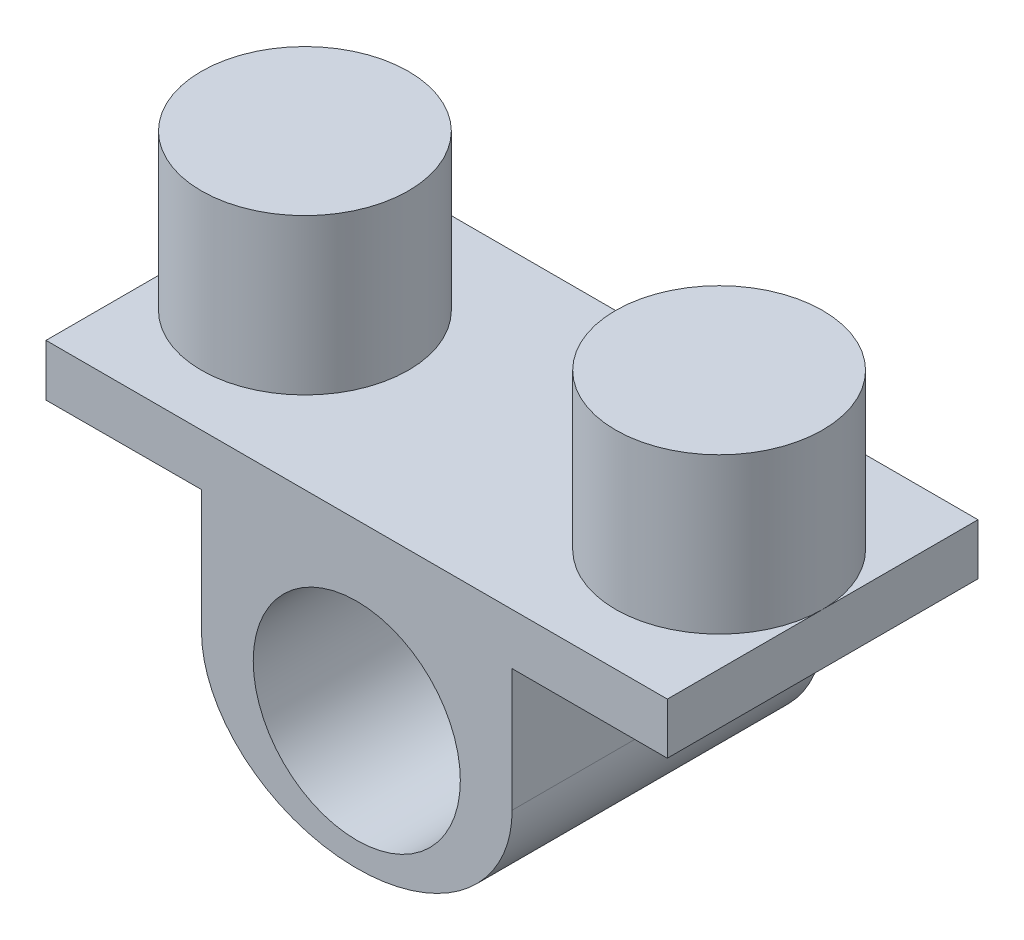
ISO-10303-21;
HEADER;
FILE_DESCRIPTION(('STEP AP214'),'2;1');
FILE_NAME('part.step','',(''),(''),'','','');
FILE_SCHEMA(('AUTOMOTIVE_DESIGN { 1 0 10303 214 1 1 1 1 }'));
ENDSEC;
DATA;
#1=APPLICATION_CONTEXT('core data for automotive mechanical design processes');
#2=APPLICATION_PROTOCOL_DEFINITION('international standard','automotive_design',2000,#1);
#3=PRODUCT_CONTEXT('',#1,'mechanical');
#4=PRODUCT('Part','Part','',(#3));
#5=PRODUCT_RELATED_PRODUCT_CATEGORY('part','',(#4));
#6=PRODUCT_DEFINITION_FORMATION('','',#4);
#7=PRODUCT_DEFINITION_CONTEXT('part definition',#1,'design');
#8=PRODUCT_DEFINITION('design','',#6,#7);
#9=PRODUCT_DEFINITION_SHAPE('','',#8);
#10=(LENGTH_UNIT() NAMED_UNIT(*) SI_UNIT(.MILLI.,.METRE.));
#11=(NAMED_UNIT(*) PLANE_ANGLE_UNIT() SI_UNIT($,.RADIAN.));
#12=(NAMED_UNIT(*) SI_UNIT($,.STERADIAN.) SOLID_ANGLE_UNIT());
#13=UNCERTAINTY_MEASURE_WITH_UNIT(LENGTH_MEASURE(1.E-05),#10,'distance_accuracy_value','');
#14=(GEOMETRIC_REPRESENTATION_CONTEXT(3) GLOBAL_UNCERTAINTY_ASSIGNED_CONTEXT((#13)) GLOBAL_UNIT_ASSIGNED_CONTEXT((#10,
#11,#12)) REPRESENTATION_CONTEXT('',''));
#15=CARTESIAN_POINT('',(0.,0.,0.));
#16=DIRECTION('',(0.,0.,1.));
#17=DIRECTION('',(1.,0.,0.));
#18=AXIS2_PLACEMENT_3D('',#15,#16,#17);
#19=CARTESIAN_POINT('',(-0.0217298672182416,33.60944127678,60.));
#20=DIRECTION('',(0.,-1.,0.));
#21=DIRECTION('',(1.,0.,0.));
#22=AXIS2_PLACEMENT_3D('',#19,#20,#21);
#23=PLANE('',#22);
#24=DIRECTION('',(0.,0.,-1.));
#25=VECTOR('',#24,1.);
#26=CARTESIAN_POINT('',(-60.0217298672183,33.60944127678,60.));
#27=LINE('',#26,#25);
#28=CARTESIAN_POINT('',(-60.0217298672183,33.60944127678,30.));
#29=VERTEX_POINT('',#28);
#30=CARTESIAN_POINT('',(-60.0217298672183,33.60944127678,0.));
#31=VERTEX_POINT('',#30);
#32=EDGE_CURVE('E141',#29,#31,#27,.T.);
#33=ORIENTED_EDGE('',*,*,#32,.F.);
#34=CARTESIAN_POINT('',(-40.0217298672183,33.60944127678,30.));
#35=DIRECTION('',(0.,1.,0.));
#36=DIRECTION('',(-1.,0.,0.));
#37=AXIS2_PLACEMENT_3D('',#34,#35,#36);
#38=CIRCLE('',#37,20.);
#39=EDGE_CURVE('E139',#29,#29,#38,.T.);
#40=ORIENTED_EDGE('',*,*,#39,.F.);
#41=CARTESIAN_POINT('',(-60.0217298672183,33.60944127678,60.));
#42=VERTEX_POINT('',#41);
#43=EDGE_CURVE('E121',#42,#29,#27,.T.);
#44=ORIENTED_EDGE('',*,*,#43,.F.);
#45=DIRECTION('',(-1.,0.,0.));
#46=VECTOR('',#45,1.);
#47=CARTESIAN_POINT('',(-0.0217298672182416,33.60944127678,60.));
#48=LINE('',#47,#46);
#49=CARTESIAN_POINT('',(59.9782701327817,33.60944127678,60.));
#50=VERTEX_POINT('',#49);
#51=EDGE_CURVE('E126',#50,#42,#48,.T.);
#52=ORIENTED_EDGE('',*,*,#51,.F.);
#53=DIRECTION('',(0.,0.,-1.));
#54=VECTOR('',#53,1.);
#55=CARTESIAN_POINT('',(59.9782701327817,33.60944127678,60.));
#56=LINE('',#55,#54);
#57=CARTESIAN_POINT('',(59.9782701327817,33.60944127678,30.));
#58=VERTEX_POINT('',#57);
#59=EDGE_CURVE('E143',#50,#58,#56,.T.);
#60=ORIENTED_EDGE('',*,*,#59,.T.);
#61=CARTESIAN_POINT('',(39.9782701327817,33.60944127678,30.));
#62=DIRECTION('',(0.,1.,0.));
#63=DIRECTION('',(-1.,0.,0.));
#64=AXIS2_PLACEMENT_3D('',#61,#62,#63);
#65=CIRCLE('',#64,20.);
#66=EDGE_CURVE('E196',#58,#58,#65,.T.);
#67=ORIENTED_EDGE('',*,*,#66,.F.);
#68=CARTESIAN_POINT('',(59.9782701327817,33.60944127678,0.));
#69=VERTEX_POINT('',#68);
#70=EDGE_CURVE('E140',#58,#69,#56,.T.);
#71=ORIENTED_EDGE('',*,*,#70,.T.);
#72=DIRECTION('',(-1.,0.,0.));
#73=VECTOR('',#72,1.);
#74=CARTESIAN_POINT('',(-0.0217298672182416,33.60944127678,0.));
#75=LINE('',#74,#73);
#76=EDGE_CURVE('E182',#69,#31,#75,.T.);
#77=ORIENTED_EDGE('',*,*,#76,.T.);
#78=EDGE_LOOP('',(#33,#40,#44,#52,#60,#67,#71,#77));
#79=FACE_BOUND('',#78,.T.);
#80=ADVANCED_FACE('F46',(#79),#23,.F.);
#81=CARTESIAN_POINT('',(-29.9999810283582,-80.2861512067363,60.));
#82=DIRECTION('',(-1.,0.,0.));
#83=DIRECTION('',(0.,-1.,0.));
#84=AXIS2_PLACEMENT_3D('',#81,#82,#83);
#85=PLANE('',#84);
#86=DIRECTION('',(0.,1.,0.));
#87=VECTOR('',#86,1.);
#88=CARTESIAN_POINT('',(-29.9999810283582,-80.2861512067363,0.));
#89=LINE('',#88,#87);
#90=CARTESIAN_POINT('',(-29.9999810283582,-0.0275473646797197,0.));
#91=VERTEX_POINT('',#90);
#92=CARTESIAN_POINT('',(-29.9999810283582,23.6645760290406,0.));
#93=VERTEX_POINT('',#92);
#94=EDGE_CURVE('E169',#91,#93,#89,.T.);
#95=ORIENTED_EDGE('',*,*,#94,.F.);
#96=DIRECTION('',(0.,0.,-1.));
#97=VECTOR('',#96,1.);
#98=CARTESIAN_POINT('',(-29.9999810283582,-0.0275473646797197,60.));
#99=LINE('',#98,#97);
#100=CARTESIAN_POINT('',(-29.9999810283582,-0.0275473646797197,60.));
#101=VERTEX_POINT('',#100);
#102=EDGE_CURVE('E13',#101,#91,#99,.T.);
#103=ORIENTED_EDGE('',*,*,#102,.F.);
#104=DIRECTION('',(0.,1.,0.));
#105=VECTOR('',#104,1.);
#106=CARTESIAN_POINT('',(-29.9999810283582,-80.2861512067363,60.));
#107=LINE('',#106,#105);
#108=CARTESIAN_POINT('',(-29.9999810283582,23.6645760290406,60.));
#109=VERTEX_POINT('',#108);
#110=EDGE_CURVE('E208',#101,#109,#107,.T.);
#111=ORIENTED_EDGE('',*,*,#110,.T.);
#112=DIRECTION('',(0.,0.,-1.));
#113=VECTOR('',#112,1.);
#114=CARTESIAN_POINT('',(-29.9999810283582,23.6645760290406,60.));
#115=LINE('',#114,#113);
#116=EDGE_CURVE('E63',#109,#93,#115,.T.);
#117=ORIENTED_EDGE('',*,*,#116,.T.);
#118=EDGE_LOOP('',(#95,#103,#111,#117));
#119=FACE_BOUND('',#118,.T.);
#120=ADVANCED_FACE('F217',(#119),#85,.T.);
#121=CARTESIAN_POINT('',(0.,0.,60.));
#122=DIRECTION('',(0.,0.,1.));
#123=DIRECTION('',(-0.999999578412344,-0.000918245682890802,0.));
#124=AXIS2_PLACEMENT_3D('',#121,#122,#123);
#125=ELLIPSE('',#124,29.9999936759852,24.6991246653066);
#126=DIRECTION('',(0.,0.,-1.));
#127=VECTOR('',#126,1.);
#128=SURFACE_OF_LINEAR_EXTRUSION('',#125,#127);
#129=CARTESIAN_POINT('',(0.,0.,0.));
#130=DIRECTION('',(0.,0.,1.));
#131=DIRECTION('',(-0.999999578412344,-0.000918245682890802,0.));
#132=AXIS2_PLACEMENT_3D('',#129,#130,#131);
#133=ELLIPSE('',#132,29.9999936759852,24.6991246653066);
#134=CARTESIAN_POINT('',(29.9999810283582,0.0275473646797197,0.));
#135=VERTEX_POINT('',#134);
#136=EDGE_CURVE('E166',#91,#135,#133,.T.);
#137=ORIENTED_EDGE('',*,*,#136,.T.);
#138=DIRECTION('',(0.,0.,-1.));
#139=VECTOR('',#138,1.);
#140=CARTESIAN_POINT('',(29.9999810283582,0.0275473646797197,60.));
#141=LINE('',#140,#139);
#142=CARTESIAN_POINT('',(29.9999810283582,0.0275473646797197,60.));
#143=VERTEX_POINT('',#142);
#144=EDGE_CURVE('E55',#143,#135,#141,.T.);
#145=ORIENTED_EDGE('',*,*,#144,.F.);
#146=EDGE_CURVE('E210',#101,#143,#125,.T.);
#147=ORIENTED_EDGE('',*,*,#146,.F.);
#148=ORIENTED_EDGE('',*,*,#102,.T.);
#149=EDGE_LOOP('',(#137,#145,#147,#148));
#150=FACE_BOUND('',#149,.T.);
#151=ADVANCED_FACE('F167',(#150),#128,.F.);
#152=CARTESIAN_POINT('',(29.9999810283582,-80.2861512067363,60.));
#153=DIRECTION('',(-1.,0.,0.));
#154=DIRECTION('',(0.,0.,1.));
#155=AXIS2_PLACEMENT_3D('',#152,#153,#154);
#156=PLANE('',#155);
#157=DIRECTION('',(0.,1.,0.));
#158=VECTOR('',#157,1.);
#159=CARTESIAN_POINT('',(29.9999810283582,-80.2861512067363,0.));
#160=LINE('',#159,#158);
#161=CARTESIAN_POINT('',(29.9999810283582,23.7196308051815,0.));
#162=VERTEX_POINT('',#161);
#163=EDGE_CURVE('E160',#135,#162,#160,.T.);
#164=ORIENTED_EDGE('',*,*,#163,.T.);
#165=DIRECTION('',(0.,0.,-1.));
#166=VECTOR('',#165,1.);
#167=CARTESIAN_POINT('',(29.9999810283582,23.7196308051815,60.));
#168=LINE('',#167,#166);
#169=CARTESIAN_POINT('',(29.9999810283582,23.7196308051815,60.));
#170=VERTEX_POINT('',#169);
#171=EDGE_CURVE('E151',#170,#162,#168,.T.);
#172=ORIENTED_EDGE('',*,*,#171,.F.);
#173=DIRECTION('',(0.,1.,0.));
#174=VECTOR('',#173,1.);
#175=CARTESIAN_POINT('',(29.9999810283582,-80.2861512067363,60.));
#176=LINE('',#175,#174);
#177=EDGE_CURVE('E162',#143,#170,#176,.T.);
#178=ORIENTED_EDGE('',*,*,#177,.F.);
#179=ORIENTED_EDGE('',*,*,#144,.T.);
#180=EDGE_LOOP('',(#164,#172,#178,#179));
#181=FACE_BOUND('',#180,.T.);
#182=ADVANCED_FACE('F158',(#181),#156,.F.);
#183=CARTESIAN_POINT('',(-0.0217298672182811,23.7196308051815,60.));
#184=DIRECTION('',(0.,1.,0.));
#185=DIRECTION('',(0.,0.,1.));
#186=AXIS2_PLACEMENT_3D('',#183,#184,#185);
#187=PLANE('',#186);
#188=DIRECTION('',(1.,0.,0.));
#189=VECTOR('',#188,1.);
#190=CARTESIAN_POINT('',(-0.0217298672182811,23.7196308051815,0.));
#191=LINE('',#190,#189);
#192=CARTESIAN_POINT('',(59.9782701327817,23.7196308051815,0.));
#193=VERTEX_POINT('',#192);
#194=EDGE_CURVE('E171',#162,#193,#191,.T.);
#195=ORIENTED_EDGE('',*,*,#194,.T.);
#196=DIRECTION('',(0.,0.,-1.));
#197=VECTOR('',#196,1.);
#198=CARTESIAN_POINT('',(59.9782701327817,23.7196308051815,60.));
#199=LINE('',#198,#197);
#200=CARTESIAN_POINT('',(59.9782701327817,23.7196308051815,60.));
#201=VERTEX_POINT('',#200);
#202=EDGE_CURVE('E148',#201,#193,#199,.T.);
#203=ORIENTED_EDGE('',*,*,#202,.F.);
#204=DIRECTION('',(1.,0.,0.));
#205=VECTOR('',#204,1.);
#206=CARTESIAN_POINT('',(-0.0217298672182811,23.7196308051815,60.));
#207=LINE('',#206,#205);
#208=EDGE_CURVE('E252',#170,#201,#207,.T.);
#209=ORIENTED_EDGE('',*,*,#208,.F.);
#210=ORIENTED_EDGE('',*,*,#171,.T.);
#211=EDGE_LOOP('',(#195,#203,#209,#210));
#212=FACE_BOUND('',#211,.T.);
#213=ADVANCED_FACE('F242',(#212),#187,.F.);
#214=CARTESIAN_POINT('',(59.9782701327817,-80.2861512067363,60.));
#215=DIRECTION('',(-1.,0.,0.));
#216=DIRECTION('',(0.,0.,1.));
#217=AXIS2_PLACEMENT_3D('',#214,#215,#216);
#218=PLANE('',#217);
#219=DIRECTION('',(0.,1.,0.));
#220=VECTOR('',#219,1.);
#221=CARTESIAN_POINT('',(59.9782701327817,-80.2861512067363,0.));
#222=LINE('',#221,#220);
#223=EDGE_CURVE('E179',#193,#69,#222,.T.);
#224=ORIENTED_EDGE('',*,*,#223,.T.);
#225=ORIENTED_EDGE('',*,*,#70,.F.);
#226=ORIENTED_EDGE('',*,*,#59,.F.);
#227=DIRECTION('',(0.,1.,0.));
#228=VECTOR('',#227,1.);
#229=CARTESIAN_POINT('',(59.9782701327817,-80.2861512067363,60.));
#230=LINE('',#229,#228);
#231=EDGE_CURVE('E132',#201,#50,#230,.T.);
#232=ORIENTED_EDGE('',*,*,#231,.F.);
#233=ORIENTED_EDGE('',*,*,#202,.T.);
#234=EDGE_LOOP('',(#224,#225,#226,#232,#233));
#235=FACE_BOUND('',#234,.T.);
#236=ADVANCED_FACE('F239',(#235),#218,.F.);
#237=CARTESIAN_POINT('',(-60.0217298672183,-80.2861512067363,60.));
#238=DIRECTION('',(1.,0.,0.));
#239=DIRECTION('',(0.,0.,-1.));
#240=AXIS2_PLACEMENT_3D('',#237,#238,#239);
#241=PLANE('',#240);
#242=DIRECTION('',(0.,-1.,0.));
#243=VECTOR('',#242,1.);
#244=CARTESIAN_POINT('',(-60.0217298672183,-80.2861512067363,0.));
#245=LINE('',#244,#243);
#246=CARTESIAN_POINT('',(-60.0217298672183,23.60944127678,0.));
#247=VERTEX_POINT('',#246);
#248=EDGE_CURVE('E185',#31,#247,#245,.T.);
#249=ORIENTED_EDGE('',*,*,#248,.T.);
#250=DIRECTION('',(0.,0.,-1.));
#251=VECTOR('',#250,1.);
#252=CARTESIAN_POINT('',(-60.0217298672183,23.60944127678,60.));
#253=LINE('',#252,#251);
#254=CARTESIAN_POINT('',(-60.0217298672183,23.60944127678,60.));
#255=VERTEX_POINT('',#254);
#256=EDGE_CURVE('E90',#255,#247,#253,.T.);
#257=ORIENTED_EDGE('',*,*,#256,.F.);
#258=DIRECTION('',(0.,-1.,0.));
#259=VECTOR('',#258,1.);
#260=CARTESIAN_POINT('',(-60.0217298672183,-80.2861512067363,60.));
#261=LINE('',#260,#259);
#262=EDGE_CURVE('E116',#42,#255,#261,.T.);
#263=ORIENTED_EDGE('',*,*,#262,.F.);
#264=ORIENTED_EDGE('',*,*,#43,.T.);
#265=ORIENTED_EDGE('',*,*,#32,.T.);
#266=EDGE_LOOP('',(#249,#257,#263,#264,#265));
#267=FACE_BOUND('',#266,.T.);
#268=ADVANCED_FACE('F118',(#267),#241,.F.);
#269=CARTESIAN_POINT('',(0.,0.,60.));
#270=DIRECTION('',(0.,0.,-1.));
#271=DIRECTION('',(-1.,0.,0.));
#272=AXIS2_PLACEMENT_3D('',#269,#270,#271);
#273=CYLINDRICAL_SURFACE('',#272,20.);
#274=CARTESIAN_POINT('',(0.,0.,60.));
#275=DIRECTION('',(0.,0.,1.));
#276=DIRECTION('',(1.,0.,0.));
#277=AXIS2_PLACEMENT_3D('',#274,#275,#276);
#278=CIRCLE('',#277,20.);
#279=CARTESIAN_POINT('',(20.,0.,60.));
#280=VERTEX_POINT('',#279);
#281=EDGE_CURVE('E189',#280,#280,#278,.T.);
#282=ORIENTED_EDGE('',*,*,#281,.T.);
#283=EDGE_LOOP('',(#282));
#284=FACE_BOUND('',#283,.T.);
#285=CARTESIAN_POINT('',(0.,0.,0.));
#286=DIRECTION('',(0.,0.,1.));
#287=DIRECTION('',(1.,0.,0.));
#288=AXIS2_PLACEMENT_3D('',#285,#286,#287);
#289=CIRCLE('',#288,20.);
#290=CARTESIAN_POINT('',(20.,0.,0.));
#291=VERTEX_POINT('',#290);
#292=EDGE_CURVE('E173',#291,#291,#289,.T.);
#293=ORIENTED_EDGE('',*,*,#292,.F.);
#294=EDGE_LOOP('',(#293));
#295=FACE_BOUND('',#294,.T.);
#296=ADVANCED_FACE('F48',(#284,#295),#273,.F.);
#297=CARTESIAN_POINT('',(-0.212735185417081,23.7192801180293,60.));
#298=DIRECTION('',(0.00183649059153941,-0.999998313649732,0.));
#299=DIRECTION('',(0.999998313649732,0.00183649059153941,0.));
#300=AXIS2_PLACEMENT_3D('',#297,#298,#299);
#301=PLANE('',#300);
#302=DIRECTION('',(-0.999998313649732,-0.00183649059153941,0.));
#303=VECTOR('',#302,1.);
#304=CARTESIAN_POINT('',(-0.212735185417081,23.7192801180293,0.));
#305=LINE('',#304,#303);
#306=EDGE_CURVE('E187',#93,#247,#305,.T.);
#307=ORIENTED_EDGE('',*,*,#306,.F.);
#308=ORIENTED_EDGE('',*,*,#116,.F.);
#309=DIRECTION('',(-0.999998313649732,-0.00183649059153941,0.));
#310=VECTOR('',#309,1.);
#311=CARTESIAN_POINT('',(-0.212735185417081,23.7192801180293,60.));
#312=LINE('',#311,#310);
#313=EDGE_CURVE('E125',#109,#255,#312,.T.);
#314=ORIENTED_EDGE('',*,*,#313,.T.);
#315=ORIENTED_EDGE('',*,*,#256,.T.);
#316=EDGE_LOOP('',(#307,#308,#314,#315));
#317=FACE_BOUND('',#316,.T.);
#318=ADVANCED_FACE('F226',(#317),#301,.T.);
#319=CARTESIAN_POINT('',(-0.0217298672182811,-80.2861512067363,60.));
#320=DIRECTION('',(0.,0.,1.));
#321=DIRECTION('',(1.,0.,0.));
#322=AXIS2_PLACEMENT_3D('',#319,#320,#321);
#323=PLANE('',#322);
#324=ORIENTED_EDGE('',*,*,#281,.F.);
#325=EDGE_LOOP('',(#324));
#326=FACE_BOUND('',#325,.T.);
#327=ORIENTED_EDGE('',*,*,#110,.F.);
#328=ORIENTED_EDGE('',*,*,#146,.T.);
#329=ORIENTED_EDGE('',*,*,#177,.T.);
#330=ORIENTED_EDGE('',*,*,#208,.T.);
#331=ORIENTED_EDGE('',*,*,#231,.T.);
#332=ORIENTED_EDGE('',*,*,#51,.T.);
#333=ORIENTED_EDGE('',*,*,#262,.T.);
#334=ORIENTED_EDGE('',*,*,#313,.F.);
#335=EDGE_LOOP('',(#327,#328,#329,#330,#331,#332,#333,#334));
#336=FACE_BOUND('',#335,.T.);
#337=ADVANCED_FACE('F130',(#326,#336),#323,.T.);
#338=CARTESIAN_POINT('',(-0.0217298672182811,-80.2861512067363,0.));
#339=DIRECTION('',(0.,0.,1.));
#340=DIRECTION('',(1.,0.,0.));
#341=AXIS2_PLACEMENT_3D('',#338,#339,#340);
#342=PLANE('',#341);
#343=ORIENTED_EDGE('',*,*,#292,.T.);
#344=EDGE_LOOP('',(#343));
#345=FACE_BOUND('',#344,.T.);
#346=ORIENTED_EDGE('',*,*,#94,.T.);
#347=ORIENTED_EDGE('',*,*,#306,.T.);
#348=ORIENTED_EDGE('',*,*,#248,.F.);
#349=ORIENTED_EDGE('',*,*,#76,.F.);
#350=ORIENTED_EDGE('',*,*,#223,.F.);
#351=ORIENTED_EDGE('',*,*,#194,.F.);
#352=ORIENTED_EDGE('',*,*,#163,.F.);
#353=ORIENTED_EDGE('',*,*,#136,.F.);
#354=EDGE_LOOP('',(#346,#347,#348,#349,#350,#351,#352,#353));
#355=FACE_BOUND('',#354,.T.);
#356=ADVANCED_FACE('F224',(#345,#355),#342,.F.);
#357=CARTESIAN_POINT('',(39.9782701327817,63.60944127678,30.));
#358=DIRECTION('',(0.,-1.,0.));
#359=DIRECTION('',(1.,0.,0.));
#360=AXIS2_PLACEMENT_3D('',#357,#358,#359);
#361=CYLINDRICAL_SURFACE('',#360,20.);
#362=CARTESIAN_POINT('',(39.9782701327817,63.60944127678,30.));
#363=DIRECTION('',(0.,1.,0.));
#364=DIRECTION('',(-1.,0.,0.));
#365=AXIS2_PLACEMENT_3D('',#362,#363,#364);
#366=CIRCLE('',#365,20.);
#367=CARTESIAN_POINT('',(19.9782701327817,63.60944127678,30.));
#368=VERTEX_POINT('',#367);
#369=EDGE_CURVE('E192',#368,#368,#366,.T.);
#370=ORIENTED_EDGE('',*,*,#369,.F.);
#371=EDGE_LOOP('',(#370));
#372=FACE_BOUND('',#371,.T.);
#373=ORIENTED_EDGE('',*,*,#66,.T.);
#374=EDGE_LOOP('',(#373));
#375=FACE_BOUND('',#374,.T.);
#376=ADVANCED_FACE('F256',(#372,#375),#361,.T.);
#377=CARTESIAN_POINT('',(-104.518314009012,63.60944127678,30.));
#378=DIRECTION('',(0.,1.,0.));
#379=DIRECTION('',(-1.,0.,0.));
#380=AXIS2_PLACEMENT_3D('',#377,#378,#379);
#381=PLANE('',#380);
#382=ORIENTED_EDGE('',*,*,#369,.T.);
#383=EDGE_LOOP('',(#382));
#384=FACE_BOUND('',#383,.T.);
#385=ADVANCED_FACE('F258',(#384),#381,.T.);
#386=CARTESIAN_POINT('',(-40.0217298672183,63.60944127678,30.));
#387=DIRECTION('',(0.,-1.,0.));
#388=DIRECTION('',(1.,0.,0.));
#389=AXIS2_PLACEMENT_3D('',#386,#387,#388);
#390=CYLINDRICAL_SURFACE('',#389,20.);
#391=CARTESIAN_POINT('',(-40.0217298672183,63.60944127678,30.));
#392=DIRECTION('',(0.,1.,0.));
#393=DIRECTION('',(-1.,0.,0.));
#394=AXIS2_PLACEMENT_3D('',#391,#392,#393);
#395=CIRCLE('',#394,20.);
#396=CARTESIAN_POINT('',(-60.0217298672183,63.60944127678,30.));
#397=VERTEX_POINT('',#396);
#398=EDGE_CURVE('E201',#397,#397,#395,.T.);
#399=ORIENTED_EDGE('',*,*,#398,.F.);
#400=EDGE_LOOP('',(#399));
#401=FACE_BOUND('',#400,.T.);
#402=ORIENTED_EDGE('',*,*,#39,.T.);
#403=EDGE_LOOP('',(#402));
#404=FACE_BOUND('',#403,.T.);
#405=ADVANCED_FACE('F265',(#401,#404),#390,.T.);
#406=CARTESIAN_POINT('',(-104.518314009012,63.60944127678,30.));
#407=DIRECTION('',(0.,1.,0.));
#408=DIRECTION('',(-1.,0.,0.));
#409=AXIS2_PLACEMENT_3D('',#406,#407,#408);
#410=PLANE('',#409);
#411=ORIENTED_EDGE('',*,*,#398,.T.);
#412=EDGE_LOOP('',(#411));
#413=FACE_BOUND('',#412,.T.);
#414=ADVANCED_FACE('F270',(#413),#410,.T.);
#415=CLOSED_SHELL('',(#80,#120,#151,#182,#213,#236,#268,#296,#318,#337,#356,#376,#385,#405,#414));
#416=MANIFOLD_SOLID_BREP('B2',#415);
#417=ADVANCED_BREP_SHAPE_REPRESENTATION('',(#18,#416),#14);
#418=SHAPE_DEFINITION_REPRESENTATION(#9,#417);
ENDSEC;
END-ISO-10303-21;
